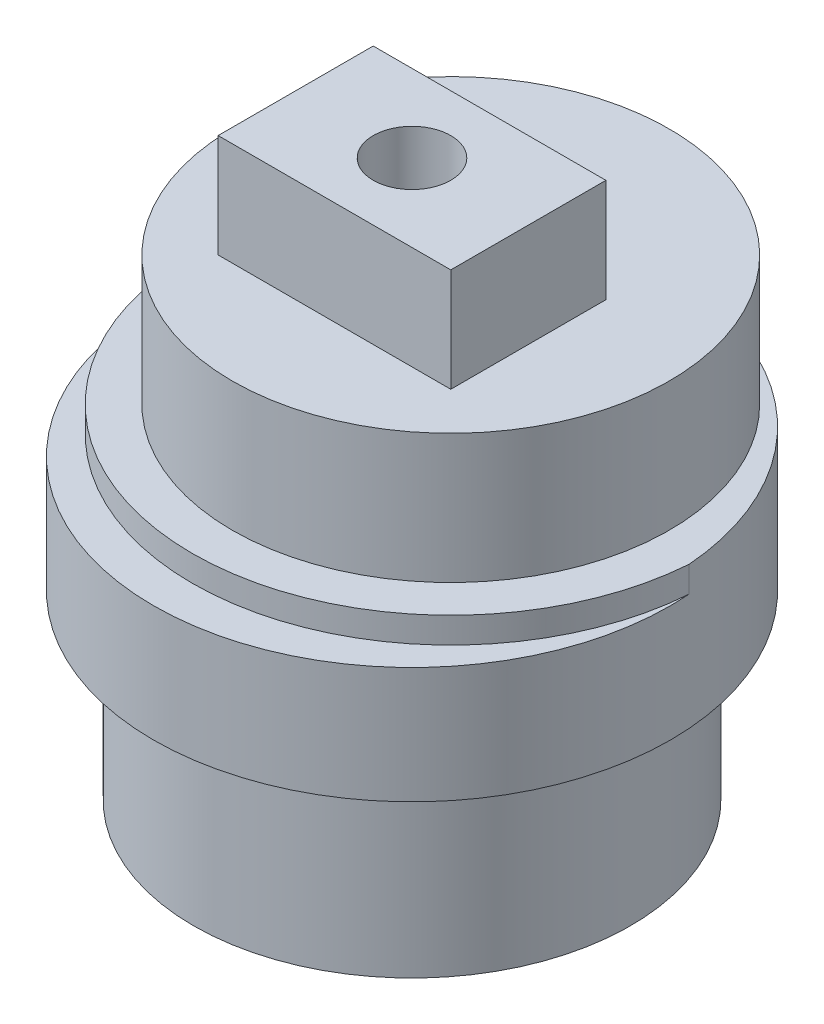
ISO-10303-21;
HEADER;
FILE_DESCRIPTION(('STEP AP214'),'2;1');
FILE_NAME('part.step','',(''),(''),'','','');
FILE_SCHEMA(('AUTOMOTIVE_DESIGN { 1 0 10303 214 1 1 1 1 }'));
ENDSEC;
DATA;
#1=APPLICATION_CONTEXT('core data for automotive mechanical design processes');
#2=APPLICATION_PROTOCOL_DEFINITION('international standard','automotive_design',2000,#1);
#3=PRODUCT_CONTEXT('',#1,'mechanical');
#4=PRODUCT('Part','Part','',(#3));
#5=PRODUCT_RELATED_PRODUCT_CATEGORY('part','',(#4));
#6=PRODUCT_DEFINITION_FORMATION('','',#4);
#7=PRODUCT_DEFINITION_CONTEXT('part definition',#1,'design');
#8=PRODUCT_DEFINITION('design','',#6,#7);
#9=PRODUCT_DEFINITION_SHAPE('','',#8);
#10=(LENGTH_UNIT() NAMED_UNIT(*) SI_UNIT(.MILLI.,.METRE.));
#11=(NAMED_UNIT(*) PLANE_ANGLE_UNIT() SI_UNIT($,.RADIAN.));
#12=(NAMED_UNIT(*) SI_UNIT($,.STERADIAN.) SOLID_ANGLE_UNIT());
#13=UNCERTAINTY_MEASURE_WITH_UNIT(LENGTH_MEASURE(1.E-05),#10,'distance_accuracy_value','');
#14=(GEOMETRIC_REPRESENTATION_CONTEXT(3) GLOBAL_UNCERTAINTY_ASSIGNED_CONTEXT((#13)) GLOBAL_UNIT_ASSIGNED_CONTEXT((#10,
#11,#12)) REPRESENTATION_CONTEXT('',''));
#15=CARTESIAN_POINT('',(0.,0.,0.));
#16=DIRECTION('',(0.,0.,1.));
#17=DIRECTION('',(1.,0.,0.));
#18=AXIS2_PLACEMENT_3D('',#15,#16,#17);
#19=CARTESIAN_POINT('',(0.,7.,0.));
#20=DIRECTION('',(0.,-1.,0.));
#21=DIRECTION('',(0.,0.,-1.));
#22=AXIS2_PLACEMENT_3D('',#19,#20,#21);
#23=CYLINDRICAL_SURFACE('',#22,8.45);
#24=CARTESIAN_POINT('',(0.,7.,0.));
#25=DIRECTION('',(0.,1.,0.));
#26=DIRECTION('',(0.,0.,1.));
#27=AXIS2_PLACEMENT_3D('',#24,#25,#26);
#28=CIRCLE('',#27,8.45);
#29=CARTESIAN_POINT('',(0.,7.,8.45));
#30=VERTEX_POINT('',#29);
#31=EDGE_CURVE('E207',#30,#30,#28,.T.);
#32=ORIENTED_EDGE('',*,*,#31,.F.);
#33=EDGE_LOOP('',(#32));
#34=FACE_BOUND('',#33,.T.);
#35=CARTESIAN_POINT('',(0.,0.,0.));
#36=DIRECTION('',(0.,1.,0.));
#37=DIRECTION('',(0.,0.,1.));
#38=AXIS2_PLACEMENT_3D('',#35,#36,#37);
#39=CIRCLE('',#38,8.45);
#40=CARTESIAN_POINT('',(0.,0.,8.45));
#41=VERTEX_POINT('',#40);
#42=EDGE_CURVE('E204',#41,#41,#39,.T.);
#43=ORIENTED_EDGE('',*,*,#42,.T.);
#44=EDGE_LOOP('',(#43));
#45=FACE_BOUND('',#44,.T.);
#46=ADVANCED_FACE('F45',(#34,#45),#23,.T.);
#47=CARTESIAN_POINT('',(0.,0.,0.));
#48=DIRECTION('',(0.,1.,0.));
#49=DIRECTION('',(0.,0.,1.));
#50=AXIS2_PLACEMENT_3D('',#47,#48,#49);
#51=PLANE('',#50);
#52=CARTESIAN_POINT('',(0.,0.,0.));
#53=DIRECTION('',(0.,1.,0.));
#54=DIRECTION('',(0.,0.,1.));
#55=AXIS2_PLACEMENT_3D('',#52,#53,#54);
#56=CIRCLE('',#55,2.75000000000001);
#57=CARTESIAN_POINT('',(1.71464281994823,0.,2.15000000000001));
#58=VERTEX_POINT('',#57);
#59=CARTESIAN_POINT('',(-1.71464281994823,0.,2.15000000000001));
#60=VERTEX_POINT('',#59);
#61=EDGE_CURVE('E67',#58,#60,#56,.T.);
#62=ORIENTED_EDGE('',*,*,#61,.T.);
#63=DIRECTION('',(1.,0.,0.));
#64=VECTOR('',#63,1.);
#65=CARTESIAN_POINT('',(0.,0.,2.15000000000001));
#66=LINE('',#65,#64);
#67=EDGE_CURVE('E60',#60,#58,#66,.T.);
#68=ORIENTED_EDGE('',*,*,#67,.T.);
#69=EDGE_LOOP('',(#62,#68));
#70=FACE_BOUND('',#69,.T.);
#71=ORIENTED_EDGE('',*,*,#42,.F.);
#72=EDGE_LOOP('',(#71));
#73=FACE_BOUND('',#72,.T.);
#74=ADVANCED_FACE('F230',(#70,#73),#51,.F.);
#75=CARTESIAN_POINT('',(0.,11.5,0.));
#76=DIRECTION('',(0.,-1.,0.));
#77=DIRECTION('',(0.,0.,-1.));
#78=AXIS2_PLACEMENT_3D('',#75,#76,#77);
#79=CYLINDRICAL_SURFACE('',#78,10.);
#80=CARTESIAN_POINT('',(0.,11.5,0.));
#81=DIRECTION('',(0.,1.,0.));
#82=DIRECTION('',(0.,0.,1.));
#83=AXIS2_PLACEMENT_3D('',#80,#81,#82);
#84=CIRCLE('',#83,10.);
#85=CARTESIAN_POINT('',(-9.97183533758957,11.5,-0.75));
#86=VERTEX_POINT('',#85);
#87=CARTESIAN_POINT('',(9.97183533758957,11.5,-0.75));
#88=VERTEX_POINT('',#87);
#89=EDGE_CURVE('E201',#86,#88,#84,.T.);
#90=ORIENTED_EDGE('',*,*,#89,.F.);
#91=DIRECTION('',(0.,-1.,0.));
#92=VECTOR('',#91,1.);
#93=CARTESIAN_POINT('',(-9.97183533758957,12.5,-0.75));
#94=LINE('',#93,#92);
#95=CARTESIAN_POINT('',(-9.97183533758957,12.5,-0.75));
#96=VERTEX_POINT('',#95);
#97=EDGE_CURVE('E195',#96,#86,#94,.T.);
#98=ORIENTED_EDGE('',*,*,#97,.F.);
#99=CARTESIAN_POINT('',(0.,12.5,0.));
#100=DIRECTION('',(0.,1.,0.));
#101=DIRECTION('',(0.,0.,1.));
#102=AXIS2_PLACEMENT_3D('',#99,#100,#101);
#103=CIRCLE('',#102,10.);
#104=CARTESIAN_POINT('',(9.97183533758957,12.5,-0.75));
#105=VERTEX_POINT('',#104);
#106=EDGE_CURVE('E186',#105,#96,#103,.T.);
#107=ORIENTED_EDGE('',*,*,#106,.F.);
#108=DIRECTION('',(0.,-1.,0.));
#109=VECTOR('',#108,1.);
#110=CARTESIAN_POINT('',(9.97183533758957,12.5,-0.75));
#111=LINE('',#110,#109);
#112=EDGE_CURVE('E191',#105,#88,#111,.T.);
#113=ORIENTED_EDGE('',*,*,#112,.T.);
#114=EDGE_LOOP('',(#90,#98,#107,#113));
#115=FACE_BOUND('',#114,.T.);
#116=CARTESIAN_POINT('',(0.,7.,0.));
#117=DIRECTION('',(0.,1.,0.));
#118=DIRECTION('',(0.,0.,1.));
#119=AXIS2_PLACEMENT_3D('',#116,#117,#118);
#120=CIRCLE('',#119,10.);
#121=CARTESIAN_POINT('',(0.,7.,10.));
#122=VERTEX_POINT('',#121);
#123=EDGE_CURVE('E200',#122,#122,#120,.T.);
#124=ORIENTED_EDGE('',*,*,#123,.T.);
#125=EDGE_LOOP('',(#124));
#126=FACE_BOUND('',#125,.T.);
#127=ADVANCED_FACE('F234',(#115,#126),#79,.T.);
#128=CARTESIAN_POINT('',(0.,11.5,0.));
#129=DIRECTION('',(0.,1.,0.));
#130=DIRECTION('',(0.,0.,1.));
#131=AXIS2_PLACEMENT_3D('',#128,#129,#130);
#132=PLANE('',#131);
#133=ORIENTED_EDGE('',*,*,#89,.T.);
#134=CARTESIAN_POINT('',(0.,11.5,-1.5));
#135=DIRECTION('',(0.,1.,0.));
#136=DIRECTION('',(0.,0.,1.));
#137=AXIS2_PLACEMENT_3D('',#134,#135,#136);
#138=CIRCLE('',#137,10.);
#139=EDGE_CURVE('E182',#86,#88,#138,.T.);
#140=ORIENTED_EDGE('',*,*,#139,.F.);
#141=EDGE_LOOP('',(#133,#140));
#142=FACE_BOUND('',#141,.T.);
#143=ADVANCED_FACE('F237',(#142),#132,.T.);
#144=CARTESIAN_POINT('',(0.,7.,0.));
#145=DIRECTION('',(0.,1.,0.));
#146=DIRECTION('',(0.,0.,1.));
#147=AXIS2_PLACEMENT_3D('',#144,#145,#146);
#148=PLANE('',#147);
#149=ORIENTED_EDGE('',*,*,#31,.T.);
#150=EDGE_LOOP('',(#149));
#151=FACE_BOUND('',#150,.T.);
#152=ORIENTED_EDGE('',*,*,#123,.F.);
#153=EDGE_LOOP('',(#152));
#154=FACE_BOUND('',#153,.T.);
#155=ADVANCED_FACE('F239',(#151,#154),#148,.F.);
#156=CARTESIAN_POINT('',(0.,12.5,-1.5));
#157=DIRECTION('',(0.,-1.,0.));
#158=DIRECTION('',(0.,0.,-1.));
#159=AXIS2_PLACEMENT_3D('',#156,#157,#158);
#160=CYLINDRICAL_SURFACE('',#159,10.);
#161=ORIENTED_EDGE('',*,*,#139,.T.);
#162=ORIENTED_EDGE('',*,*,#112,.F.);
#163=CARTESIAN_POINT('',(0.,12.5,-1.5));
#164=DIRECTION('',(0.,1.,0.));
#165=DIRECTION('',(0.,0.,1.));
#166=AXIS2_PLACEMENT_3D('',#163,#164,#165);
#167=CIRCLE('',#166,10.);
#168=EDGE_CURVE('E189',#96,#105,#167,.T.);
#169=ORIENTED_EDGE('',*,*,#168,.F.);
#170=ORIENTED_EDGE('',*,*,#97,.T.);
#171=EDGE_LOOP('',(#161,#162,#169,#170));
#172=FACE_BOUND('',#171,.T.);
#173=ADVANCED_FACE('F242',(#172),#160,.T.);
#174=CARTESIAN_POINT('',(0.,12.5,0.));
#175=DIRECTION('',(0.,1.,0.));
#176=DIRECTION('',(0.,0.,1.));
#177=AXIS2_PLACEMENT_3D('',#174,#175,#176);
#178=PLANE('',#177);
#179=CARTESIAN_POINT('',(0.,12.5,-1.5));
#180=DIRECTION('',(0.,1.,0.));
#181=DIRECTION('',(0.,0.,1.));
#182=AXIS2_PLACEMENT_3D('',#179,#180,#181);
#183=CIRCLE('',#182,8.45);
#184=CARTESIAN_POINT('',(0.,12.5,6.95));
#185=VERTEX_POINT('',#184);
#186=EDGE_CURVE('E183',#185,#185,#183,.F.);
#187=ORIENTED_EDGE('',*,*,#186,.T.);
#188=EDGE_LOOP('',(#187));
#189=FACE_BOUND('',#188,.T.);
#190=ORIENTED_EDGE('',*,*,#106,.T.);
#191=ORIENTED_EDGE('',*,*,#168,.T.);
#192=EDGE_LOOP('',(#190,#191));
#193=FACE_BOUND('',#192,.T.);
#194=ADVANCED_FACE('F255',(#189,#193),#178,.T.);
#195=CARTESIAN_POINT('',(0.,17.5,-1.5));
#196=DIRECTION('',(0.,1.,0.));
#197=DIRECTION('',(0.,0.,1.));
#198=AXIS2_PLACEMENT_3D('',#195,#196,#197);
#199=PLANE('',#198);
#200=DIRECTION('',(0.,0.,-1.));
#201=VECTOR('',#200,1.);
#202=CARTESIAN_POINT('',(4.5,17.5,3.));
#203=LINE('',#202,#201);
#204=CARTESIAN_POINT('',(4.5,17.5,3.));
#205=VERTEX_POINT('',#204);
#206=CARTESIAN_POINT('',(4.5,17.5,-3.));
#207=VERTEX_POINT('',#206);
#208=EDGE_CURVE('E147',#205,#207,#203,.T.);
#209=ORIENTED_EDGE('',*,*,#208,.F.);
#210=DIRECTION('',(1.,0.,0.));
#211=VECTOR('',#210,1.);
#212=CARTESIAN_POINT('',(-4.5,17.5,3.));
#213=LINE('',#212,#211);
#214=CARTESIAN_POINT('',(-4.5,17.5,3.));
#215=VERTEX_POINT('',#214);
#216=EDGE_CURVE('E154',#215,#205,#213,.T.);
#217=ORIENTED_EDGE('',*,*,#216,.F.);
#218=DIRECTION('',(0.,0.,1.));
#219=VECTOR('',#218,1.);
#220=CARTESIAN_POINT('',(-4.5,17.5,3.));
#221=LINE('',#220,#219);
#222=CARTESIAN_POINT('',(-4.5,17.5,-3.));
#223=VERTEX_POINT('',#222);
#224=EDGE_CURVE('E166',#223,#215,#221,.T.);
#225=ORIENTED_EDGE('',*,*,#224,.F.);
#226=DIRECTION('',(-1.,0.,0.));
#227=VECTOR('',#226,1.);
#228=CARTESIAN_POINT('',(-4.5,17.5,-3.));
#229=LINE('',#228,#227);
#230=EDGE_CURVE('E163',#207,#223,#229,.T.);
#231=ORIENTED_EDGE('',*,*,#230,.F.);
#232=EDGE_LOOP('',(#209,#217,#225,#231));
#233=FACE_BOUND('',#232,.T.);
#234=CARTESIAN_POINT('',(0.,17.5,-1.5));
#235=DIRECTION('',(0.,1.,0.));
#236=DIRECTION('',(0.,0.,1.));
#237=AXIS2_PLACEMENT_3D('',#234,#235,#236);
#238=CIRCLE('',#237,8.45);
#239=CARTESIAN_POINT('',(0.,17.5,6.95));
#240=VERTEX_POINT('',#239);
#241=EDGE_CURVE('E197',#240,#240,#238,.T.);
#242=ORIENTED_EDGE('',*,*,#241,.T.);
#243=EDGE_LOOP('',(#242));
#244=FACE_BOUND('',#243,.T.);
#245=ADVANCED_FACE('F251',(#233,#244),#199,.T.);
#246=CARTESIAN_POINT('',(0.,17.5,-1.5));
#247=DIRECTION('',(0.,-1.,0.));
#248=DIRECTION('',(0.,0.,-1.));
#249=AXIS2_PLACEMENT_3D('',#246,#247,#248);
#250=CYLINDRICAL_SURFACE('',#249,8.45);
#251=ORIENTED_EDGE('',*,*,#186,.F.);
#252=EDGE_LOOP('',(#251));
#253=FACE_BOUND('',#252,.T.);
#254=ORIENTED_EDGE('',*,*,#241,.F.);
#255=EDGE_LOOP('',(#254));
#256=FACE_BOUND('',#255,.T.);
#257=ADVANCED_FACE('F247',(#253,#256),#250,.T.);
#258=CARTESIAN_POINT('',(4.5,21.5,3.));
#259=DIRECTION('',(-1.,0.,0.));
#260=DIRECTION('',(0.,0.,1.));
#261=AXIS2_PLACEMENT_3D('',#258,#259,#260);
#262=PLANE('',#261);
#263=ORIENTED_EDGE('',*,*,#208,.T.);
#264=DIRECTION('',(0.,-1.,0.));
#265=VECTOR('',#264,1.);
#266=CARTESIAN_POINT('',(4.5,21.5,-3.));
#267=LINE('',#266,#265);
#268=CARTESIAN_POINT('',(4.5,21.5,-3.));
#269=VERTEX_POINT('',#268);
#270=EDGE_CURVE('E179',#269,#207,#267,.T.);
#271=ORIENTED_EDGE('',*,*,#270,.F.);
#272=DIRECTION('',(0.,0.,-1.));
#273=VECTOR('',#272,1.);
#274=CARTESIAN_POINT('',(4.5,21.5,3.));
#275=LINE('',#274,#273);
#276=CARTESIAN_POINT('',(4.5,21.5,3.));
#277=VERTEX_POINT('',#276);
#278=EDGE_CURVE('E150',#277,#269,#275,.T.);
#279=ORIENTED_EDGE('',*,*,#278,.F.);
#280=DIRECTION('',(0.,-1.,0.));
#281=VECTOR('',#280,1.);
#282=CARTESIAN_POINT('',(4.5,21.5,3.));
#283=LINE('',#282,#281);
#284=EDGE_CURVE('E160',#277,#205,#283,.T.);
#285=ORIENTED_EDGE('',*,*,#284,.T.);
#286=EDGE_LOOP('',(#263,#271,#279,#285));
#287=FACE_BOUND('',#286,.T.);
#288=ADVANCED_FACE('F250',(#287),#262,.F.);
#289=CARTESIAN_POINT('',(-4.5,21.5,-3.));
#290=DIRECTION('',(0.,0.,1.));
#291=DIRECTION('',(1.,0.,0.));
#292=AXIS2_PLACEMENT_3D('',#289,#290,#291);
#293=PLANE('',#292);
#294=ORIENTED_EDGE('',*,*,#230,.T.);
#295=DIRECTION('',(0.,-1.,0.));
#296=VECTOR('',#295,1.);
#297=CARTESIAN_POINT('',(-4.5,21.5,-3.));
#298=LINE('',#297,#296);
#299=CARTESIAN_POINT('',(-4.5,21.5,-3.));
#300=VERTEX_POINT('',#299);
#301=EDGE_CURVE('E176',#300,#223,#298,.T.);
#302=ORIENTED_EDGE('',*,*,#301,.F.);
#303=DIRECTION('',(-1.,0.,0.));
#304=VECTOR('',#303,1.);
#305=CARTESIAN_POINT('',(-4.5,21.5,-3.));
#306=LINE('',#305,#304);
#307=EDGE_CURVE('E153',#269,#300,#306,.T.);
#308=ORIENTED_EDGE('',*,*,#307,.F.);
#309=ORIENTED_EDGE('',*,*,#270,.T.);
#310=EDGE_LOOP('',(#294,#302,#308,#309));
#311=FACE_BOUND('',#310,.T.);
#312=ADVANCED_FACE('F265',(#311),#293,.F.);
#313=CARTESIAN_POINT('',(-4.5,21.5,3.));
#314=DIRECTION('',(1.,0.,0.));
#315=DIRECTION('',(0.,0.,-1.));
#316=AXIS2_PLACEMENT_3D('',#313,#314,#315);
#317=PLANE('',#316);
#318=ORIENTED_EDGE('',*,*,#224,.T.);
#319=DIRECTION('',(0.,-1.,0.));
#320=VECTOR('',#319,1.);
#321=CARTESIAN_POINT('',(-4.5,21.5,3.));
#322=LINE('',#321,#320);
#323=CARTESIAN_POINT('',(-4.5,21.5,3.));
#324=VERTEX_POINT('',#323);
#325=EDGE_CURVE('E173',#324,#215,#322,.T.);
#326=ORIENTED_EDGE('',*,*,#325,.F.);
#327=DIRECTION('',(0.,0.,1.));
#328=VECTOR('',#327,1.);
#329=CARTESIAN_POINT('',(-4.5,21.5,3.));
#330=LINE('',#329,#328);
#331=EDGE_CURVE('E156',#300,#324,#330,.T.);
#332=ORIENTED_EDGE('',*,*,#331,.F.);
#333=ORIENTED_EDGE('',*,*,#301,.T.);
#334=EDGE_LOOP('',(#318,#326,#332,#333));
#335=FACE_BOUND('',#334,.T.);
#336=ADVANCED_FACE('F269',(#335),#317,.F.);
#337=CARTESIAN_POINT('',(-4.5,21.5,3.));
#338=DIRECTION('',(0.,0.,-1.));
#339=DIRECTION('',(-1.,0.,0.));
#340=AXIS2_PLACEMENT_3D('',#337,#338,#339);
#341=PLANE('',#340);
#342=ORIENTED_EDGE('',*,*,#216,.T.);
#343=ORIENTED_EDGE('',*,*,#284,.F.);
#344=DIRECTION('',(1.,0.,0.));
#345=VECTOR('',#344,1.);
#346=CARTESIAN_POINT('',(-4.5,21.5,3.));
#347=LINE('',#346,#345);
#348=EDGE_CURVE('E158',#324,#277,#347,.T.);
#349=ORIENTED_EDGE('',*,*,#348,.F.);
#350=ORIENTED_EDGE('',*,*,#325,.T.);
#351=EDGE_LOOP('',(#342,#343,#349,#350));
#352=FACE_BOUND('',#351,.T.);
#353=ADVANCED_FACE('F273',(#352),#341,.F.);
#354=CARTESIAN_POINT('',(0.,21.5,0.));
#355=DIRECTION('',(0.,-1.,0.));
#356=DIRECTION('',(0.,0.,-1.));
#357=AXIS2_PLACEMENT_3D('',#354,#355,#356);
#358=PLANE('',#357);
#359=CARTESIAN_POINT('',(0.,21.5,0.));
#360=DIRECTION('',(0.,1.,0.));
#361=DIRECTION('',(0.,0.,1.));
#362=AXIS2_PLACEMENT_3D('',#359,#360,#361);
#363=CIRCLE('',#362,1.5);
#364=CARTESIAN_POINT('',(0.,21.5,1.5));
#365=VERTEX_POINT('',#364);
#366=EDGE_CURVE('E142',#365,#365,#363,.T.);
#367=ORIENTED_EDGE('',*,*,#366,.F.);
#368=EDGE_LOOP('',(#367));
#369=FACE_BOUND('',#368,.T.);
#370=ORIENTED_EDGE('',*,*,#278,.T.);
#371=ORIENTED_EDGE('',*,*,#307,.T.);
#372=ORIENTED_EDGE('',*,*,#331,.T.);
#373=ORIENTED_EDGE('',*,*,#348,.T.);
#374=EDGE_LOOP('',(#370,#371,#372,#373));
#375=FACE_BOUND('',#374,.T.);
#376=ADVANCED_FACE('F277',(#369,#375),#358,.F.);
#377=CARTESIAN_POINT('',(0.,13.5,0.));
#378=DIRECTION('',(0.,1.,0.));
#379=DIRECTION('',(0.,0.,1.));
#380=AXIS2_PLACEMENT_3D('',#377,#378,#379);
#381=CYLINDRICAL_SURFACE('',#380,1.5);
#382=CARTESIAN_POINT('',(0.,13.5,0.));
#383=DIRECTION('',(0.,1.,0.));
#384=DIRECTION('',(0.,0.,1.));
#385=AXIS2_PLACEMENT_3D('',#382,#383,#384);
#386=CIRCLE('',#385,1.5);
#387=CARTESIAN_POINT('',(0.,13.5,1.5));
#388=VERTEX_POINT('',#387);
#389=EDGE_CURVE('E144',#388,#388,#386,.T.);
#390=ORIENTED_EDGE('',*,*,#389,.F.);
#391=EDGE_LOOP('',(#390));
#392=FACE_BOUND('',#391,.T.);
#393=ORIENTED_EDGE('',*,*,#366,.T.);
#394=EDGE_LOOP('',(#393));
#395=FACE_BOUND('',#394,.T.);
#396=ADVANCED_FACE('F281',(#392,#395),#381,.F.);
#397=CARTESIAN_POINT('',(0.,13.5,0.));
#398=DIRECTION('',(0.,1.,0.));
#399=DIRECTION('',(0.,0.,1.));
#400=AXIS2_PLACEMENT_3D('',#397,#398,#399);
#401=PLANE('',#400);
#402=ORIENTED_EDGE('',*,*,#389,.T.);
#403=EDGE_LOOP('',(#402));
#404=FACE_BOUND('',#403,.T.);
#405=ADVANCED_FACE('F285',(#404),#401,.T.);
#406=CARTESIAN_POINT('',(0.,10.,0.));
#407=DIRECTION('',(0.,-1.,0.));
#408=DIRECTION('',(0.,0.,-1.));
#409=AXIS2_PLACEMENT_3D('',#406,#407,#408);
#410=CYLINDRICAL_SURFACE('',#409,1.75);
#411=DIRECTION('',(0.,-1.,0.));
#412=VECTOR('',#411,1.);
#413=CARTESIAN_POINT('',(-1.31909059582729,10.,1.15));
#414=LINE('',#413,#412);
#415=CARTESIAN_POINT('',(-1.31909059582729,10.,1.15));
#416=VERTEX_POINT('',#415);
#417=CARTESIAN_POINT('',(-1.31909059582729,1.,1.15));
#418=VERTEX_POINT('',#417);
#419=EDGE_CURVE('E133',#416,#418,#414,.T.);
#420=ORIENTED_EDGE('',*,*,#419,.T.);
#421=CARTESIAN_POINT('',(0.,1.,0.));
#422=DIRECTION('',(0.,1.,0.));
#423=DIRECTION('',(0.,0.,1.));
#424=AXIS2_PLACEMENT_3D('',#421,#422,#423);
#425=CIRCLE('',#424,1.75);
#426=CARTESIAN_POINT('',(1.31909059582729,1.,1.15));
#427=VERTEX_POINT('',#426);
#428=EDGE_CURVE('E11',#418,#427,#425,.F.);
#429=ORIENTED_EDGE('',*,*,#428,.T.);
#430=DIRECTION('',(0.,-1.,0.));
#431=VECTOR('',#430,1.);
#432=CARTESIAN_POINT('',(1.31909059582729,10.,1.15));
#433=LINE('',#432,#431);
#434=CARTESIAN_POINT('',(1.31909059582729,10.,1.15));
#435=VERTEX_POINT('',#434);
#436=EDGE_CURVE('E123',#435,#427,#433,.T.);
#437=ORIENTED_EDGE('',*,*,#436,.F.);
#438=CARTESIAN_POINT('',(0.,10.,0.));
#439=DIRECTION('',(0.,-1.,0.));
#440=DIRECTION('',(0.,0.,-1.));
#441=AXIS2_PLACEMENT_3D('',#438,#439,#440);
#442=CIRCLE('',#441,1.75);
#443=EDGE_CURVE('E127',#416,#435,#442,.T.);
#444=ORIENTED_EDGE('',*,*,#443,.F.);
#445=EDGE_LOOP('',(#420,#429,#437,#444));
#446=FACE_BOUND('',#445,.T.);
#447=ADVANCED_FACE('F126',(#446),#410,.F.);
#448=CARTESIAN_POINT('',(-1.31909059582729,10.,1.15));
#449=DIRECTION('',(0.,0.,1.));
#450=DIRECTION('',(1.,0.,0.));
#451=AXIS2_PLACEMENT_3D('',#448,#449,#450);
#452=PLANE('',#451);
#453=ORIENTED_EDGE('',*,*,#436,.T.);
#454=DIRECTION('',(-1.,0.,0.));
#455=VECTOR('',#454,1.);
#456=CARTESIAN_POINT('',(-1.31909059582729,1.,1.15));
#457=LINE('',#456,#455);
#458=EDGE_CURVE('E210',#427,#418,#457,.T.);
#459=ORIENTED_EDGE('',*,*,#458,.T.);
#460=ORIENTED_EDGE('',*,*,#419,.F.);
#461=DIRECTION('',(-1.,0.,0.));
#462=VECTOR('',#461,1.);
#463=CARTESIAN_POINT('',(-1.31909059582729,10.,1.15));
#464=LINE('',#463,#462);
#465=EDGE_CURVE('E134',#435,#416,#464,.T.);
#466=ORIENTED_EDGE('',*,*,#465,.F.);
#467=EDGE_LOOP('',(#453,#459,#460,#466));
#468=FACE_BOUND('',#467,.T.);
#469=ADVANCED_FACE('F139',(#468),#452,.F.);
#470=CARTESIAN_POINT('',(0.,10.,0.));
#471=DIRECTION('',(0.,-1.,0.));
#472=DIRECTION('',(0.,0.,-1.));
#473=AXIS2_PLACEMENT_3D('',#470,#471,#472);
#474=PLANE('',#473);
#475=ORIENTED_EDGE('',*,*,#443,.T.);
#476=ORIENTED_EDGE('',*,*,#465,.T.);
#477=EDGE_LOOP('',(#475,#476));
#478=FACE_BOUND('',#477,.T.);
#479=ADVANCED_FACE('F137',(#478),#474,.T.);
#480=CARTESIAN_POINT('',(0.,1.,0.));
#481=DIRECTION('',(0.,-1.,0.));
#482=DIRECTION('',(0.,0.,-1.));
#483=AXIS2_PLACEMENT_3D('',#480,#481,#482);
#484=CONICAL_SURFACE('',#483,1.75,0.785398163397451);
#485=CARTESIAN_POINT('',(-1.31909059582729,1.,1.15));
#486=CARTESIAN_POINT('',(-1.35654943596138,0.917579865208402,1.2324201347916));
#487=CARTESIAN_POINT('',(-1.39261449655039,0.834850725572046,1.31514927442796));
#488=CARTESIAN_POINT('',(-1.46237297860077,0.668918651452811,1.4810813485472));
#489=CARTESIAN_POINT('',(-1.49606707616399,0.585715859411313,1.56428414058869));
#490=CARTESIAN_POINT('',(-1.56151552900608,0.418946064435708,1.7310539355643));
#491=CARTESIAN_POINT('',(-1.5932701790282,0.335379118921437,1.81462088107857));
#492=CARTESIAN_POINT('',(-1.65512874463734,0.167914392741129,1.98208560725888));
#493=CARTESIAN_POINT('',(-1.68523218767666,0.0840165246581106,2.0659834753419));
#494=CARTESIAN_POINT('',(-1.71464281994823,0.,2.15000000000001));
#495=B_SPLINE_CURVE_WITH_KNOTS('',3,(#485,#486,#487,#488,#489,#490,#491,#492,#493,#494),
.UNSPECIFIED.,.F.,.F.,(4,2,2,2,4),(0.,0.36726901522376,0.734432872308476,1.10154079091816,
1.46875322729912),.UNSPECIFIED.);
#496=EDGE_CURVE('E215',#60,#418,#495,.F.);
#497=ORIENTED_EDGE('',*,*,#496,.F.);
#498=ORIENTED_EDGE('',*,*,#61,.F.);
#499=CARTESIAN_POINT('',(1.71464281994823,0.,2.15000000000001));
#500=CARTESIAN_POINT('',(1.68523218767666,0.0840165246581105,2.0659834753419));
#501=CARTESIAN_POINT('',(1.65512874463734,0.167914392741129,1.98208560725888));
#502=CARTESIAN_POINT('',(1.5932701790282,0.335379118921437,1.81462088107857));
#503=CARTESIAN_POINT('',(1.56151552900608,0.418946064435708,1.7310539355643));
#504=CARTESIAN_POINT('',(1.49606707616399,0.585715859411313,1.56428414058869));
#505=CARTESIAN_POINT('',(1.46237297860077,0.66891865145281,1.4810813485472));
#506=CARTESIAN_POINT('',(1.39261449655039,0.834850725572045,1.31514927442796));
#507=CARTESIAN_POINT('',(1.35654943596138,0.917579865208402,1.2324201347916));
#508=CARTESIAN_POINT('',(1.31909059582729,1.,1.15));
#509=B_SPLINE_CURVE_WITH_KNOTS('',3,(#499,#500,#501,#502,#503,#504,#505,#506,#507,#508),
.UNSPECIFIED.,.F.,.F.,(4,2,2,2,4),(0.,0.367212436380961,0.734320354990643,1.10148421207536,
1.46875322729912),.UNSPECIFIED.);
#510=EDGE_CURVE('E51',#427,#58,#509,.F.);
#511=ORIENTED_EDGE('',*,*,#510,.F.);
#512=ORIENTED_EDGE('',*,*,#428,.F.);
#513=EDGE_LOOP('',(#497,#498,#511,#512));
#514=FACE_BOUND('',#513,.T.);
#515=ADVANCED_FACE('F48',(#514),#484,.F.);
#516=CARTESIAN_POINT('',(-1.31909059582729,1.,1.15));
#517=DIRECTION('',(0.,0.707106781186549,0.707106781186546));
#518=DIRECTION('',(-1.,0.,0.));
#519=AXIS2_PLACEMENT_3D('',#516,#517,#518);
#520=PLANE('',#519);
#521=ORIENTED_EDGE('',*,*,#510,.T.);
#522=ORIENTED_EDGE('',*,*,#67,.F.);
#523=ORIENTED_EDGE('',*,*,#496,.T.);
#524=ORIENTED_EDGE('',*,*,#458,.F.);
#525=EDGE_LOOP('',(#521,#522,#523,#524));
#526=FACE_BOUND('',#525,.T.);
#527=ADVANCED_FACE('F221',(#526),#520,.F.);
#528=CLOSED_SHELL('',(#46,#74,#127,#143,#155,#173,#194,#245,#257,#288,#312,#336,#353,#376,#396,
#405,#447,#469,#479,#515,#527));
#529=MANIFOLD_SOLID_BREP('B2',#528);
#530=ADVANCED_BREP_SHAPE_REPRESENTATION('',(#18,#529),#14);
#531=SHAPE_DEFINITION_REPRESENTATION(#9,#530);
ENDSEC;
END-ISO-10303-21;
